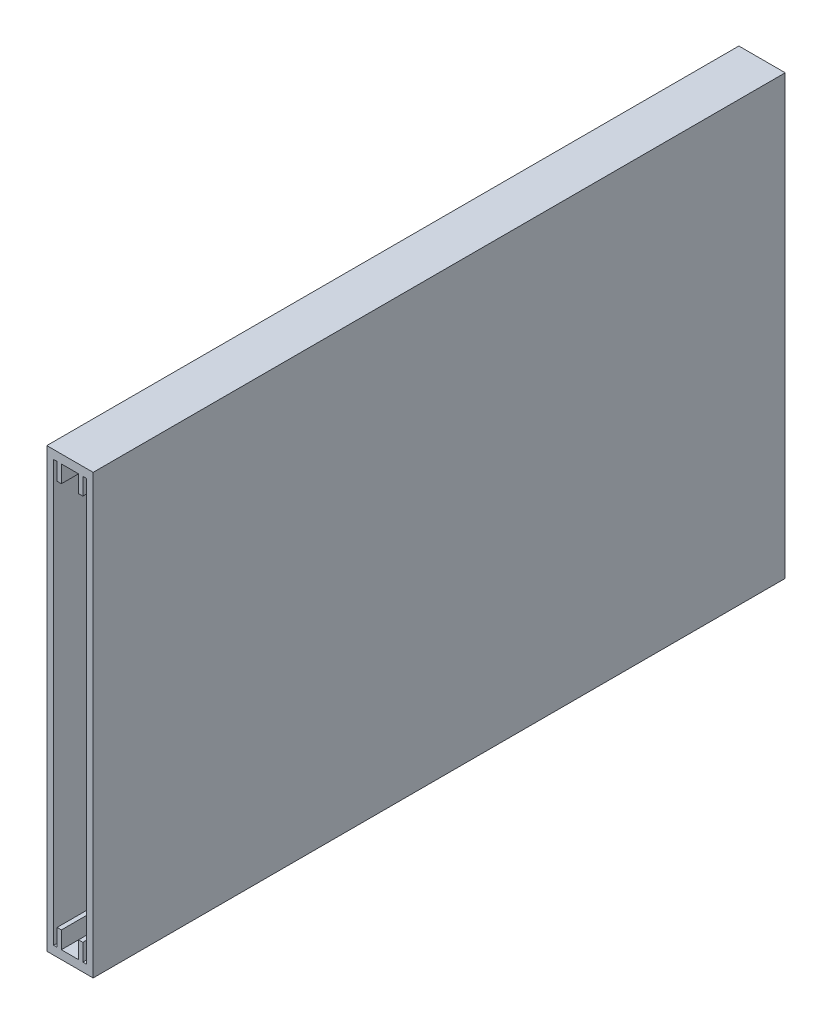
ISO-10303-21;
HEADER;
FILE_DESCRIPTION(('STEP AP214'),'2;1');
FILE_NAME('part.step','',(''),(''),'','','');
FILE_SCHEMA(('AUTOMOTIVE_DESIGN { 1 0 10303 214 1 1 1 1 }'));
ENDSEC;
DATA;
#1=APPLICATION_CONTEXT('core data for automotive mechanical design processes');
#2=APPLICATION_PROTOCOL_DEFINITION('international standard','automotive_design',2000,#1);
#3=PRODUCT_CONTEXT('',#1,'mechanical');
#4=PRODUCT('Part','Part','',(#3));
#5=PRODUCT_RELATED_PRODUCT_CATEGORY('part','',(#4));
#6=PRODUCT_DEFINITION_FORMATION('','',#4);
#7=PRODUCT_DEFINITION_CONTEXT('part definition',#1,'design');
#8=PRODUCT_DEFINITION('design','',#6,#7);
#9=PRODUCT_DEFINITION_SHAPE('','',#8);
#10=(LENGTH_UNIT() NAMED_UNIT(*) SI_UNIT(.MILLI.,.METRE.));
#11=(NAMED_UNIT(*) PLANE_ANGLE_UNIT() SI_UNIT($,.RADIAN.));
#12=(NAMED_UNIT(*) SI_UNIT($,.STERADIAN.) SOLID_ANGLE_UNIT());
#13=UNCERTAINTY_MEASURE_WITH_UNIT(LENGTH_MEASURE(1.E-05),#10,'distance_accuracy_value','');
#14=(GEOMETRIC_REPRESENTATION_CONTEXT(3) GLOBAL_UNCERTAINTY_ASSIGNED_CONTEXT((#13)) GLOBAL_UNIT_ASSIGNED_CONTEXT((#10,
#11,#12)) REPRESENTATION_CONTEXT('',''));
#15=CARTESIAN_POINT('',(0.,0.,0.));
#16=DIRECTION('',(0.,0.,1.));
#17=DIRECTION('',(1.,0.,0.));
#18=AXIS2_PLACEMENT_3D('',#15,#16,#17);
#19=CARTESIAN_POINT('',(0.,0.,1.2));
#20=DIRECTION('',(0.,1.,0.));
#21=DIRECTION('',(0.,0.,1.));
#22=AXIS2_PLACEMENT_3D('',#19,#20,#21);
#23=PLANE('',#22);
#24=DIRECTION('',(1.,0.,0.));
#25=VECTOR('',#24,1.);
#26=CARTESIAN_POINT('',(0.,0.,0.));
#27=LINE('',#26,#25);
#28=CARTESIAN_POINT('',(-10.8,0.,0.));
#29=VERTEX_POINT('',#28);
#30=CARTESIAN_POINT('',(0.,0.,0.));
#31=VERTEX_POINT('',#30);
#32=EDGE_CURVE('E365',#29,#31,#27,.T.);
#33=ORIENTED_EDGE('',*,*,#32,.T.);
#34=DIRECTION('',(0.,0.,-1.));
#35=VECTOR('',#34,1.);
#36=CARTESIAN_POINT('',(0.,0.,1.2));
#37=LINE('',#36,#35);
#38=CARTESIAN_POINT('',(0.,0.,161.2));
#39=VERTEX_POINT('',#38);
#40=EDGE_CURVE('E11',#39,#31,#37,.T.);
#41=ORIENTED_EDGE('',*,*,#40,.F.);
#42=DIRECTION('',(1.,0.,0.));
#43=VECTOR('',#42,1.);
#44=CARTESIAN_POINT('',(-10.8,0.,161.2));
#45=LINE('',#44,#43);
#46=CARTESIAN_POINT('',(-10.8,0.,161.2));
#47=VERTEX_POINT('',#46);
#48=EDGE_CURVE('E356',#47,#39,#45,.T.);
#49=ORIENTED_EDGE('',*,*,#48,.F.);
#50=DIRECTION('',(0.,0.,-1.));
#51=VECTOR('',#50,1.);
#52=CARTESIAN_POINT('',(-10.8,0.,1.2));
#53=LINE('',#52,#51);
#54=EDGE_CURVE('E373',#47,#29,#53,.T.);
#55=ORIENTED_EDGE('',*,*,#54,.T.);
#56=EDGE_LOOP('',(#33,#41,#49,#55));
#57=FACE_BOUND('',#56,.T.);
#58=ADVANCED_FACE('F39',(#57),#23,.F.);
#59=CARTESIAN_POINT('',(0.,0.,1.2));
#60=DIRECTION('',(-1.,0.,0.));
#61=DIRECTION('',(0.,0.,1.));
#62=AXIS2_PLACEMENT_3D('',#59,#60,#61);
#63=PLANE('',#62);
#64=DIRECTION('',(0.,1.,0.));
#65=VECTOR('',#64,1.);
#66=CARTESIAN_POINT('',(0.,0.,0.));
#67=LINE('',#66,#65);
#68=CARTESIAN_POINT('',(0.,102.,0.));
#69=VERTEX_POINT('',#68);
#70=EDGE_CURVE('E368',#31,#69,#67,.T.);
#71=ORIENTED_EDGE('',*,*,#70,.T.);
#72=DIRECTION('',(0.,0.,-1.));
#73=VECTOR('',#72,1.);
#74=CARTESIAN_POINT('',(0.,102.,1.2));
#75=LINE('',#74,#73);
#76=CARTESIAN_POINT('',(0.,102.,161.2));
#77=VERTEX_POINT('',#76);
#78=EDGE_CURVE('E46',#77,#69,#75,.T.);
#79=ORIENTED_EDGE('',*,*,#78,.F.);
#80=DIRECTION('',(0.,1.,0.));
#81=VECTOR('',#80,1.);
#82=CARTESIAN_POINT('',(0.,102.,161.2));
#83=LINE('',#82,#81);
#84=EDGE_CURVE('E359',#39,#77,#83,.T.);
#85=ORIENTED_EDGE('',*,*,#84,.F.);
#86=ORIENTED_EDGE('',*,*,#40,.T.);
#87=EDGE_LOOP('',(#71,#79,#85,#86));
#88=FACE_BOUND('',#87,.T.);
#89=ADVANCED_FACE('F391',(#88),#63,.F.);
#90=CARTESIAN_POINT('',(0.,102.,1.2));
#91=DIRECTION('',(0.,-1.,0.));
#92=DIRECTION('',(0.,0.,-1.));
#93=AXIS2_PLACEMENT_3D('',#90,#91,#92);
#94=PLANE('',#93);
#95=DIRECTION('',(-1.,0.,0.));
#96=VECTOR('',#95,1.);
#97=CARTESIAN_POINT('',(0.,102.,0.));
#98=LINE('',#97,#96);
#99=CARTESIAN_POINT('',(-10.8,102.,0.));
#100=VERTEX_POINT('',#99);
#101=EDGE_CURVE('E370',#69,#100,#98,.T.);
#102=ORIENTED_EDGE('',*,*,#101,.T.);
#103=DIRECTION('',(0.,0.,-1.));
#104=VECTOR('',#103,1.);
#105=CARTESIAN_POINT('',(-10.8,102.,1.2));
#106=LINE('',#105,#104);
#107=CARTESIAN_POINT('',(-10.8,102.,161.2));
#108=VERTEX_POINT('',#107);
#109=EDGE_CURVE('E375',#108,#100,#106,.T.);
#110=ORIENTED_EDGE('',*,*,#109,.F.);
#111=DIRECTION('',(-1.,0.,0.));
#112=VECTOR('',#111,1.);
#113=CARTESIAN_POINT('',(-10.8,102.,161.2));
#114=LINE('',#113,#112);
#115=EDGE_CURVE('E362',#77,#108,#114,.T.);
#116=ORIENTED_EDGE('',*,*,#115,.F.);
#117=ORIENTED_EDGE('',*,*,#78,.T.);
#118=EDGE_LOOP('',(#102,#110,#116,#117));
#119=FACE_BOUND('',#118,.T.);
#120=ADVANCED_FACE('F380',(#119),#94,.F.);
#121=CARTESIAN_POINT('',(-10.8,0.,1.2));
#122=DIRECTION('',(1.,0.,0.));
#123=DIRECTION('',(0.,0.,-1.));
#124=AXIS2_PLACEMENT_3D('',#121,#122,#123);
#125=PLANE('',#124);
#126=DIRECTION('',(0.,-1.,0.));
#127=VECTOR('',#126,1.);
#128=CARTESIAN_POINT('',(-10.8,0.,0.));
#129=LINE('',#128,#127);
#130=EDGE_CURVE('E61',#100,#29,#129,.T.);
#131=ORIENTED_EDGE('',*,*,#130,.T.);
#132=ORIENTED_EDGE('',*,*,#54,.F.);
#133=DIRECTION('',(0.,-1.,0.));
#134=VECTOR('',#133,1.);
#135=CARTESIAN_POINT('',(-10.8,102.,161.2));
#136=LINE('',#135,#134);
#137=EDGE_CURVE('E217',#108,#47,#136,.T.);
#138=ORIENTED_EDGE('',*,*,#137,.F.);
#139=ORIENTED_EDGE('',*,*,#109,.T.);
#140=EDGE_LOOP('',(#131,#132,#138,#139));
#141=FACE_BOUND('',#140,.T.);
#142=ADVANCED_FACE('F389',(#141),#125,.F.);
#143=CARTESIAN_POINT('',(0.,0.,0.));
#144=DIRECTION('',(0.,0.,-1.));
#145=DIRECTION('',(-1.,0.,0.));
#146=AXIS2_PLACEMENT_3D('',#143,#144,#145);
#147=PLANE('',#146);
#148=ORIENTED_EDGE('',*,*,#32,.F.);
#149=ORIENTED_EDGE('',*,*,#130,.F.);
#150=ORIENTED_EDGE('',*,*,#101,.F.);
#151=ORIENTED_EDGE('',*,*,#70,.F.);
#152=EDGE_LOOP('',(#148,#149,#150,#151));
#153=FACE_BOUND('',#152,.T.);
#154=ADVANCED_FACE('F385',(#153),#147,.T.);
#155=CARTESIAN_POINT('',(0.,0.,161.2));
#156=DIRECTION('',(0.,0.,1.));
#157=DIRECTION('',(1.,0.,0.));
#158=AXIS2_PLACEMENT_3D('',#155,#156,#157);
#159=PLANE('',#158);
#160=ORIENTED_EDGE('',*,*,#137,.T.);
#161=ORIENTED_EDGE('',*,*,#48,.T.);
#162=ORIENTED_EDGE('',*,*,#84,.T.);
#163=ORIENTED_EDGE('',*,*,#115,.T.);
#164=EDGE_LOOP('',(#160,#161,#162,#163));
#165=FACE_BOUND('',#164,.T.);
#166=DIRECTION('',(1.,0.,0.));
#167=VECTOR('',#166,1.);
#168=CARTESIAN_POINT('',(-9.19999999999999,2.,161.2));
#169=LINE('',#168,#167);
#170=CARTESIAN_POINT('',(-9.19999999999999,2.,161.2));
#171=VERTEX_POINT('',#170);
#172=CARTESIAN_POINT('',(-8.4000000000095,2.,161.2));
#173=VERTEX_POINT('',#172);
#174=EDGE_CURVE('E209',#171,#173,#169,.T.);
#175=ORIENTED_EDGE('',*,*,#174,.F.);
#176=DIRECTION('',(0.,-1.,0.));
#177=VECTOR('',#176,1.);
#178=CARTESIAN_POINT('',(-9.20000000000004,100.,161.2));
#179=LINE('',#178,#177);
#180=CARTESIAN_POINT('',(-9.20000000000004,100.,161.2));
#181=VERTEX_POINT('',#180);
#182=EDGE_CURVE('E201',#181,#171,#179,.T.);
#183=ORIENTED_EDGE('',*,*,#182,.F.);
#184=DIRECTION('',(-1.,0.,0.));
#185=VECTOR('',#184,1.);
#186=CARTESIAN_POINT('',(-9.20000000000004,100.,161.2));
#187=LINE('',#186,#185);
#188=CARTESIAN_POINT('',(-8.40000000000004,100.,161.2));
#189=VERTEX_POINT('',#188);
#190=EDGE_CURVE('E260',#189,#181,#187,.T.);
#191=ORIENTED_EDGE('',*,*,#190,.F.);
#192=DIRECTION('',(0.,1.,0.));
#193=VECTOR('',#192,1.);
#194=CARTESIAN_POINT('',(-8.40000000000004,96.,161.2));
#195=LINE('',#194,#193);
#196=CARTESIAN_POINT('',(-8.40000000000004,96.,161.2));
#197=VERTEX_POINT('',#196);
#198=EDGE_CURVE('E257',#197,#189,#195,.T.);
#199=ORIENTED_EDGE('',*,*,#198,.F.);
#200=DIRECTION('',(-1.,0.,0.));
#201=VECTOR('',#200,1.);
#202=CARTESIAN_POINT('',(-8.40000000000004,96.,161.2));
#203=LINE('',#202,#201);
#204=CARTESIAN_POINT('',(-7.40000000000004,96.,161.2));
#205=VERTEX_POINT('',#204);
#206=EDGE_CURVE('E255',#205,#197,#203,.T.);
#207=ORIENTED_EDGE('',*,*,#206,.F.);
#208=DIRECTION('',(0.,-1.,0.));
#209=VECTOR('',#208,1.);
#210=CARTESIAN_POINT('',(-7.40000000000004,96.,161.2));
#211=LINE('',#210,#209);
#212=CARTESIAN_POINT('',(-7.40000000000004,100.,161.2));
#213=VERTEX_POINT('',#212);
#214=EDGE_CURVE('E253',#213,#205,#211,.T.);
#215=ORIENTED_EDGE('',*,*,#214,.F.);
#216=DIRECTION('',(-1.,0.,0.));
#217=VECTOR('',#216,1.);
#218=CARTESIAN_POINT('',(-7.40000000000004,100.,161.2));
#219=LINE('',#218,#217);
#220=CARTESIAN_POINT('',(-3.40000000000004,100.,161.2));
#221=VERTEX_POINT('',#220);
#222=EDGE_CURVE('E251',#221,#213,#219,.T.);
#223=ORIENTED_EDGE('',*,*,#222,.F.);
#224=DIRECTION('',(0.,1.,0.));
#225=VECTOR('',#224,1.);
#226=CARTESIAN_POINT('',(-3.4,96.,161.2));
#227=LINE('',#226,#225);
#228=CARTESIAN_POINT('',(-3.4,96.,161.2));
#229=VERTEX_POINT('',#228);
#230=EDGE_CURVE('E249',#229,#221,#227,.T.);
#231=ORIENTED_EDGE('',*,*,#230,.F.);
#232=DIRECTION('',(-1.,0.,0.));
#233=VECTOR('',#232,1.);
#234=CARTESIAN_POINT('',(-3.4,96.,161.2));
#235=LINE('',#234,#233);
#236=CARTESIAN_POINT('',(-2.4,96.,161.2));
#237=VERTEX_POINT('',#236);
#238=EDGE_CURVE('E247',#237,#229,#235,.T.);
#239=ORIENTED_EDGE('',*,*,#238,.F.);
#240=DIRECTION('',(0.,-1.,0.));
#241=VECTOR('',#240,1.);
#242=CARTESIAN_POINT('',(-2.4,96.,161.2));
#243=LINE('',#242,#241);
#244=CARTESIAN_POINT('',(-2.4,100.,161.2));
#245=VERTEX_POINT('',#244);
#246=EDGE_CURVE('E245',#245,#237,#243,.T.);
#247=ORIENTED_EDGE('',*,*,#246,.F.);
#248=DIRECTION('',(-1.,0.,0.));
#249=VECTOR('',#248,1.);
#250=CARTESIAN_POINT('',(-2.4,100.,161.2));
#251=LINE('',#250,#249);
#252=CARTESIAN_POINT('',(-1.6,100.,161.2));
#253=VERTEX_POINT('',#252);
#254=EDGE_CURVE('E243',#253,#245,#251,.T.);
#255=ORIENTED_EDGE('',*,*,#254,.F.);
#256=DIRECTION('',(0.,1.,0.));
#257=VECTOR('',#256,1.);
#258=CARTESIAN_POINT('',(-1.6,100.,161.2));
#259=LINE('',#258,#257);
#260=CARTESIAN_POINT('',(-1.59999999999999,2.,161.2));
#261=VERTEX_POINT('',#260);
#262=EDGE_CURVE('E241',#261,#253,#259,.T.);
#263=ORIENTED_EDGE('',*,*,#262,.F.);
#264=DIRECTION('',(1.,0.,0.));
#265=VECTOR('',#264,1.);
#266=CARTESIAN_POINT('',(-2.39999999999999,2.,161.2));
#267=LINE('',#266,#265);
#268=CARTESIAN_POINT('',(-2.39999999999999,2.,161.2));
#269=VERTEX_POINT('',#268);
#270=EDGE_CURVE('E239',#269,#261,#267,.T.);
#271=ORIENTED_EDGE('',*,*,#270,.F.);
#272=DIRECTION('',(0.,-1.,0.));
#273=VECTOR('',#272,1.);
#274=CARTESIAN_POINT('',(-2.39999999999999,2.,161.2));
#275=LINE('',#274,#273);
#276=CARTESIAN_POINT('',(-2.39999999999999,5.99999999999534,161.2));
#277=VERTEX_POINT('',#276);
#278=EDGE_CURVE('E237',#277,#269,#275,.T.);
#279=ORIENTED_EDGE('',*,*,#278,.F.);
#280=DIRECTION('',(1.,0.,0.));
#281=VECTOR('',#280,1.);
#282=CARTESIAN_POINT('',(-3.39999999999999,5.99999999999534,161.2));
#283=LINE('',#282,#281);
#284=CARTESIAN_POINT('',(-3.39999999999999,5.99999999999534,161.2));
#285=VERTEX_POINT('',#284);
#286=EDGE_CURVE('E235',#285,#277,#283,.T.);
#287=ORIENTED_EDGE('',*,*,#286,.F.);
#288=DIRECTION('',(0.,1.,0.));
#289=VECTOR('',#288,1.);
#290=CARTESIAN_POINT('',(-3.39999999999999,2.,161.2));
#291=LINE('',#290,#289);
#292=CARTESIAN_POINT('',(-3.39999999999999,2.,161.2));
#293=VERTEX_POINT('',#292);
#294=EDGE_CURVE('E233',#293,#285,#291,.T.);
#295=ORIENTED_EDGE('',*,*,#294,.F.);
#296=DIRECTION('',(1.,0.,0.));
#297=VECTOR('',#296,1.);
#298=CARTESIAN_POINT('',(-7.4000000000095,2.,161.2));
#299=LINE('',#298,#297);
#300=CARTESIAN_POINT('',(-7.4000000000095,2.,161.2));
#301=VERTEX_POINT('',#300);
#302=EDGE_CURVE('E231',#301,#293,#299,.T.);
#303=ORIENTED_EDGE('',*,*,#302,.F.);
#304=DIRECTION('',(0.,-1.,0.));
#305=VECTOR('',#304,1.);
#306=CARTESIAN_POINT('',(-7.4000000000095,2.,161.2));
#307=LINE('',#306,#305);
#308=CARTESIAN_POINT('',(-7.4000000000095,5.99999999999534,161.2));
#309=VERTEX_POINT('',#308);
#310=EDGE_CURVE('E229',#309,#301,#307,.T.);
#311=ORIENTED_EDGE('',*,*,#310,.F.);
#312=DIRECTION('',(1.,0.,0.));
#313=VECTOR('',#312,1.);
#314=CARTESIAN_POINT('',(-8.4000000000095,5.99999999999534,161.2));
#315=LINE('',#314,#313);
#316=CARTESIAN_POINT('',(-8.4000000000095,5.99999999999534,161.2));
#317=VERTEX_POINT('',#316);
#318=EDGE_CURVE('E225',#317,#309,#315,.T.);
#319=ORIENTED_EDGE('',*,*,#318,.F.);
#320=DIRECTION('',(0.,1.,0.));
#321=VECTOR('',#320,1.);
#322=CARTESIAN_POINT('',(-8.4000000000095,2.,161.2));
#323=LINE('',#322,#321);
#324=EDGE_CURVE('E223',#173,#317,#323,.T.);
#325=ORIENTED_EDGE('',*,*,#324,.F.);
#326=EDGE_LOOP('',(#175,#183,#191,#199,#207,#215,#223,#231,#239,#247,#255,#263,#271,#279,#287,
#295,#303,#311,#319,#325));
#327=FACE_BOUND('',#326,.T.);
#328=ADVANCED_FACE('F221',(#165,#327),#159,.T.);
#329=CARTESIAN_POINT('',(-9.20000000000004,100.,161.2));
#330=DIRECTION('',(1.,0.,0.));
#331=DIRECTION('',(0.,1.,0.));
#332=AXIS2_PLACEMENT_3D('',#329,#330,#331);
#333=PLANE('',#332);
#334=DIRECTION('',(0.,-1.,0.));
#335=VECTOR('',#334,1.);
#336=CARTESIAN_POINT('',(-9.20000000000004,100.,1.2));
#337=LINE('',#336,#335);
#338=CARTESIAN_POINT('',(-9.20000000000004,100.,1.2));
#339=VERTEX_POINT('',#338);
#340=CARTESIAN_POINT('',(-9.19999999999999,2.,1.2));
#341=VERTEX_POINT('',#340);
#342=EDGE_CURVE('E262',#339,#341,#337,.T.);
#343=ORIENTED_EDGE('',*,*,#342,.F.);
#344=DIRECTION('',(0.,0.,-1.));
#345=VECTOR('',#344,1.);
#346=CARTESIAN_POINT('',(-9.20000000000004,100.,161.2));
#347=LINE('',#346,#345);
#348=EDGE_CURVE('E53',#181,#339,#347,.T.);
#349=ORIENTED_EDGE('',*,*,#348,.F.);
#350=ORIENTED_EDGE('',*,*,#182,.T.);
#351=DIRECTION('',(0.,0.,-1.));
#352=VECTOR('',#351,1.);
#353=CARTESIAN_POINT('',(-9.19999999999999,2.,161.2));
#354=LINE('',#353,#352);
#355=EDGE_CURVE('E204',#171,#341,#354,.T.);
#356=ORIENTED_EDGE('',*,*,#355,.T.);
#357=EDGE_LOOP('',(#343,#349,#350,#356));
#358=FACE_BOUND('',#357,.T.);
#359=ADVANCED_FACE('F203',(#358),#333,.T.);
#360=CARTESIAN_POINT('',(-9.19999999999999,2.,161.2));
#361=DIRECTION('',(0.,1.,0.));
#362=DIRECTION('',(-1.,0.,0.));
#363=AXIS2_PLACEMENT_3D('',#360,#361,#362);
#364=PLANE('',#363);
#365=DIRECTION('',(1.,0.,0.));
#366=VECTOR('',#365,1.);
#367=CARTESIAN_POINT('',(-9.19999999999999,2.,1.2));
#368=LINE('',#367,#366);
#369=CARTESIAN_POINT('',(-8.4000000000095,2.,1.2));
#370=VERTEX_POINT('',#369);
#371=EDGE_CURVE('E216',#341,#370,#368,.T.);
#372=ORIENTED_EDGE('',*,*,#371,.F.);
#373=ORIENTED_EDGE('',*,*,#355,.F.);
#374=ORIENTED_EDGE('',*,*,#174,.T.);
#375=DIRECTION('',(0.,0.,-1.));
#376=VECTOR('',#375,1.);
#377=CARTESIAN_POINT('',(-8.4000000000095,2.,161.2));
#378=LINE('',#377,#376);
#379=EDGE_CURVE('E218',#173,#370,#378,.T.);
#380=ORIENTED_EDGE('',*,*,#379,.T.);
#381=EDGE_LOOP('',(#372,#373,#374,#380));
#382=FACE_BOUND('',#381,.T.);
#383=ADVANCED_FACE('F213',(#382),#364,.T.);
#384=CARTESIAN_POINT('',(-8.4000000000095,2.,161.2));
#385=DIRECTION('',(-1.,0.,0.));
#386=DIRECTION('',(0.,-1.,0.));
#387=AXIS2_PLACEMENT_3D('',#384,#385,#386);
#388=PLANE('',#387);
#389=DIRECTION('',(0.,1.,0.));
#390=VECTOR('',#389,1.);
#391=CARTESIAN_POINT('',(-8.4000000000095,2.,1.2));
#392=LINE('',#391,#390);
#393=CARTESIAN_POINT('',(-8.4000000000095,5.99999999999534,1.2));
#394=VERTEX_POINT('',#393);
#395=EDGE_CURVE('E265',#370,#394,#392,.T.);
#396=ORIENTED_EDGE('',*,*,#395,.F.);
#397=ORIENTED_EDGE('',*,*,#379,.F.);
#398=ORIENTED_EDGE('',*,*,#324,.T.);
#399=DIRECTION('',(0.,0.,-1.));
#400=VECTOR('',#399,1.);
#401=CARTESIAN_POINT('',(-8.4000000000095,5.99999999999534,161.2));
#402=LINE('',#401,#400);
#403=EDGE_CURVE('E351',#317,#394,#402,.T.);
#404=ORIENTED_EDGE('',*,*,#403,.T.);
#405=EDGE_LOOP('',(#396,#397,#398,#404));
#406=FACE_BOUND('',#405,.T.);
#407=ADVANCED_FACE('F414',(#406),#388,.T.);
#408=CARTESIAN_POINT('',(-8.4000000000095,5.99999999999534,161.2));
#409=DIRECTION('',(0.,1.,0.));
#410=DIRECTION('',(-1.,0.,0.));
#411=AXIS2_PLACEMENT_3D('',#408,#409,#410);
#412=PLANE('',#411);
#413=DIRECTION('',(1.,0.,0.));
#414=VECTOR('',#413,1.);
#415=CARTESIAN_POINT('',(-8.4000000000095,5.99999999999534,1.2));
#416=LINE('',#415,#414);
#417=CARTESIAN_POINT('',(-7.4000000000095,5.99999999999534,1.2));
#418=VERTEX_POINT('',#417);
#419=EDGE_CURVE('E268',#394,#418,#416,.T.);
#420=ORIENTED_EDGE('',*,*,#419,.F.);
#421=ORIENTED_EDGE('',*,*,#403,.F.);
#422=ORIENTED_EDGE('',*,*,#318,.T.);
#423=DIRECTION('',(0.,0.,-1.));
#424=VECTOR('',#423,1.);
#425=CARTESIAN_POINT('',(-7.4000000000095,5.99999999999534,161.2));
#426=LINE('',#425,#424);
#427=EDGE_CURVE('E349',#309,#418,#426,.T.);
#428=ORIENTED_EDGE('',*,*,#427,.T.);
#429=EDGE_LOOP('',(#420,#421,#422,#428));
#430=FACE_BOUND('',#429,.T.);
#431=ADVANCED_FACE('F417',(#430),#412,.T.);
#432=CARTESIAN_POINT('',(-7.4000000000095,2.,161.2));
#433=DIRECTION('',(1.,0.,0.));
#434=DIRECTION('',(0.,1.,0.));
#435=AXIS2_PLACEMENT_3D('',#432,#433,#434);
#436=PLANE('',#435);
#437=DIRECTION('',(0.,-1.,0.));
#438=VECTOR('',#437,1.);
#439=CARTESIAN_POINT('',(-7.4000000000095,2.,1.2));
#440=LINE('',#439,#438);
#441=CARTESIAN_POINT('',(-7.4000000000095,2.,1.2));
#442=VERTEX_POINT('',#441);
#443=EDGE_CURVE('E271',#418,#442,#440,.T.);
#444=ORIENTED_EDGE('',*,*,#443,.F.);
#445=ORIENTED_EDGE('',*,*,#427,.F.);
#446=ORIENTED_EDGE('',*,*,#310,.T.);
#447=DIRECTION('',(0.,0.,-1.));
#448=VECTOR('',#447,1.);
#449=CARTESIAN_POINT('',(-7.4000000000095,2.,161.2));
#450=LINE('',#449,#448);
#451=EDGE_CURVE('E347',#301,#442,#450,.T.);
#452=ORIENTED_EDGE('',*,*,#451,.T.);
#453=EDGE_LOOP('',(#444,#445,#446,#452));
#454=FACE_BOUND('',#453,.T.);
#455=ADVANCED_FACE('F421',(#454),#436,.T.);
#456=CARTESIAN_POINT('',(-7.4000000000095,2.,161.2));
#457=DIRECTION('',(0.,1.,0.));
#458=DIRECTION('',(-1.,0.,0.));
#459=AXIS2_PLACEMENT_3D('',#456,#457,#458);
#460=PLANE('',#459);
#461=DIRECTION('',(1.,0.,0.));
#462=VECTOR('',#461,1.);
#463=CARTESIAN_POINT('',(-7.4000000000095,2.,1.2));
#464=LINE('',#463,#462);
#465=CARTESIAN_POINT('',(-3.39999999999999,2.,1.2));
#466=VERTEX_POINT('',#465);
#467=EDGE_CURVE('E274',#442,#466,#464,.T.);
#468=ORIENTED_EDGE('',*,*,#467,.F.);
#469=ORIENTED_EDGE('',*,*,#451,.F.);
#470=ORIENTED_EDGE('',*,*,#302,.T.);
#471=DIRECTION('',(0.,0.,-1.));
#472=VECTOR('',#471,1.);
#473=CARTESIAN_POINT('',(-3.39999999999999,2.,161.2));
#474=LINE('',#473,#472);
#475=EDGE_CURVE('E345',#293,#466,#474,.T.);
#476=ORIENTED_EDGE('',*,*,#475,.T.);
#477=EDGE_LOOP('',(#468,#469,#470,#476));
#478=FACE_BOUND('',#477,.T.);
#479=ADVANCED_FACE('F425',(#478),#460,.T.);
#480=CARTESIAN_POINT('',(-3.39999999999999,2.,161.2));
#481=DIRECTION('',(-1.,0.,0.));
#482=DIRECTION('',(0.,-1.,0.));
#483=AXIS2_PLACEMENT_3D('',#480,#481,#482);
#484=PLANE('',#483);
#485=DIRECTION('',(0.,1.,0.));
#486=VECTOR('',#485,1.);
#487=CARTESIAN_POINT('',(-3.39999999999999,2.,1.2));
#488=LINE('',#487,#486);
#489=CARTESIAN_POINT('',(-3.39999999999999,5.99999999999534,1.2));
#490=VERTEX_POINT('',#489);
#491=EDGE_CURVE('E277',#466,#490,#488,.T.);
#492=ORIENTED_EDGE('',*,*,#491,.F.);
#493=ORIENTED_EDGE('',*,*,#475,.F.);
#494=ORIENTED_EDGE('',*,*,#294,.T.);
#495=DIRECTION('',(0.,0.,-1.));
#496=VECTOR('',#495,1.);
#497=CARTESIAN_POINT('',(-3.39999999999999,5.99999999999534,161.2));
#498=LINE('',#497,#496);
#499=EDGE_CURVE('E343',#285,#490,#498,.T.);
#500=ORIENTED_EDGE('',*,*,#499,.T.);
#501=EDGE_LOOP('',(#492,#493,#494,#500));
#502=FACE_BOUND('',#501,.T.);
#503=ADVANCED_FACE('F429',(#502),#484,.T.);
#504=CARTESIAN_POINT('',(-3.39999999999999,5.99999999999534,161.2));
#505=DIRECTION('',(0.,1.,0.));
#506=DIRECTION('',(-1.,0.,0.));
#507=AXIS2_PLACEMENT_3D('',#504,#505,#506);
#508=PLANE('',#507);
#509=DIRECTION('',(1.,0.,0.));
#510=VECTOR('',#509,1.);
#511=CARTESIAN_POINT('',(-3.39999999999999,5.99999999999534,1.2));
#512=LINE('',#511,#510);
#513=CARTESIAN_POINT('',(-2.39999999999999,5.99999999999534,1.2));
#514=VERTEX_POINT('',#513);
#515=EDGE_CURVE('E280',#490,#514,#512,.T.);
#516=ORIENTED_EDGE('',*,*,#515,.F.);
#517=ORIENTED_EDGE('',*,*,#499,.F.);
#518=ORIENTED_EDGE('',*,*,#286,.T.);
#519=DIRECTION('',(0.,0.,-1.));
#520=VECTOR('',#519,1.);
#521=CARTESIAN_POINT('',(-2.39999999999999,5.99999999999534,161.2));
#522=LINE('',#521,#520);
#523=EDGE_CURVE('E341',#277,#514,#522,.T.);
#524=ORIENTED_EDGE('',*,*,#523,.T.);
#525=EDGE_LOOP('',(#516,#517,#518,#524));
#526=FACE_BOUND('',#525,.T.);
#527=ADVANCED_FACE('F433',(#526),#508,.T.);
#528=CARTESIAN_POINT('',(-2.39999999999999,2.,161.2));
#529=DIRECTION('',(1.,0.,0.));
#530=DIRECTION('',(0.,1.,0.));
#531=AXIS2_PLACEMENT_3D('',#528,#529,#530);
#532=PLANE('',#531);
#533=DIRECTION('',(0.,-1.,0.));
#534=VECTOR('',#533,1.);
#535=CARTESIAN_POINT('',(-2.39999999999999,2.,1.2));
#536=LINE('',#535,#534);
#537=CARTESIAN_POINT('',(-2.39999999999999,2.,1.2));
#538=VERTEX_POINT('',#537);
#539=EDGE_CURVE('E283',#514,#538,#536,.T.);
#540=ORIENTED_EDGE('',*,*,#539,.F.);
#541=ORIENTED_EDGE('',*,*,#523,.F.);
#542=ORIENTED_EDGE('',*,*,#278,.T.);
#543=DIRECTION('',(0.,0.,-1.));
#544=VECTOR('',#543,1.);
#545=CARTESIAN_POINT('',(-2.39999999999999,2.,161.2));
#546=LINE('',#545,#544);
#547=EDGE_CURVE('E339',#269,#538,#546,.T.);
#548=ORIENTED_EDGE('',*,*,#547,.T.);
#549=EDGE_LOOP('',(#540,#541,#542,#548));
#550=FACE_BOUND('',#549,.T.);
#551=ADVANCED_FACE('F437',(#550),#532,.T.);
#552=CARTESIAN_POINT('',(-2.39999999999999,2.,161.2));
#553=DIRECTION('',(0.,1.,0.));
#554=DIRECTION('',(-1.,0.,0.));
#555=AXIS2_PLACEMENT_3D('',#552,#553,#554);
#556=PLANE('',#555);
#557=DIRECTION('',(1.,0.,0.));
#558=VECTOR('',#557,1.);
#559=CARTESIAN_POINT('',(-2.39999999999999,2.,1.2));
#560=LINE('',#559,#558);
#561=CARTESIAN_POINT('',(-1.59999999999999,2.,1.2));
#562=VERTEX_POINT('',#561);
#563=EDGE_CURVE('E286',#538,#562,#560,.T.);
#564=ORIENTED_EDGE('',*,*,#563,.F.);
#565=ORIENTED_EDGE('',*,*,#547,.F.);
#566=ORIENTED_EDGE('',*,*,#270,.T.);
#567=DIRECTION('',(0.,0.,-1.));
#568=VECTOR('',#567,1.);
#569=CARTESIAN_POINT('',(-1.59999999999999,2.,161.2));
#570=LINE('',#569,#568);
#571=EDGE_CURVE('E337',#261,#562,#570,.T.);
#572=ORIENTED_EDGE('',*,*,#571,.T.);
#573=EDGE_LOOP('',(#564,#565,#566,#572));
#574=FACE_BOUND('',#573,.T.);
#575=ADVANCED_FACE('F441',(#574),#556,.T.);
#576=CARTESIAN_POINT('',(-1.6,100.,161.2));
#577=DIRECTION('',(-1.,0.,0.));
#578=DIRECTION('',(0.,-1.,0.));
#579=AXIS2_PLACEMENT_3D('',#576,#577,#578);
#580=PLANE('',#579);
#581=DIRECTION('',(0.,1.,0.));
#582=VECTOR('',#581,1.);
#583=CARTESIAN_POINT('',(-1.6,100.,1.2));
#584=LINE('',#583,#582);
#585=CARTESIAN_POINT('',(-1.6,100.,1.2));
#586=VERTEX_POINT('',#585);
#587=EDGE_CURVE('E289',#562,#586,#584,.T.);
#588=ORIENTED_EDGE('',*,*,#587,.F.);
#589=ORIENTED_EDGE('',*,*,#571,.F.);
#590=ORIENTED_EDGE('',*,*,#262,.T.);
#591=DIRECTION('',(0.,0.,-1.));
#592=VECTOR('',#591,1.);
#593=CARTESIAN_POINT('',(-1.6,100.,161.2));
#594=LINE('',#593,#592);
#595=EDGE_CURVE('E335',#253,#586,#594,.T.);
#596=ORIENTED_EDGE('',*,*,#595,.T.);
#597=EDGE_LOOP('',(#588,#589,#590,#596));
#598=FACE_BOUND('',#597,.T.);
#599=ADVANCED_FACE('F445',(#598),#580,.T.);
#600=CARTESIAN_POINT('',(-2.4,100.,161.2));
#601=DIRECTION('',(0.,-1.,0.));
#602=DIRECTION('',(0.,0.,-1.));
#603=AXIS2_PLACEMENT_3D('',#600,#601,#602);
#604=PLANE('',#603);
#605=DIRECTION('',(-1.,0.,0.));
#606=VECTOR('',#605,1.);
#607=CARTESIAN_POINT('',(-2.4,100.,1.2));
#608=LINE('',#607,#606);
#609=CARTESIAN_POINT('',(-2.4,100.,1.2));
#610=VERTEX_POINT('',#609);
#611=EDGE_CURVE('E292',#586,#610,#608,.T.);
#612=ORIENTED_EDGE('',*,*,#611,.F.);
#613=ORIENTED_EDGE('',*,*,#595,.F.);
#614=ORIENTED_EDGE('',*,*,#254,.T.);
#615=DIRECTION('',(0.,0.,-1.));
#616=VECTOR('',#615,1.);
#617=CARTESIAN_POINT('',(-2.4,100.,161.2));
#618=LINE('',#617,#616);
#619=EDGE_CURVE('E333',#245,#610,#618,.T.);
#620=ORIENTED_EDGE('',*,*,#619,.T.);
#621=EDGE_LOOP('',(#612,#613,#614,#620));
#622=FACE_BOUND('',#621,.T.);
#623=ADVANCED_FACE('F449',(#622),#604,.T.);
#624=CARTESIAN_POINT('',(-2.4,96.,161.2));
#625=DIRECTION('',(1.,0.,0.));
#626=DIRECTION('',(0.,1.,0.));
#627=AXIS2_PLACEMENT_3D('',#624,#625,#626);
#628=PLANE('',#627);
#629=DIRECTION('',(0.,-1.,0.));
#630=VECTOR('',#629,1.);
#631=CARTESIAN_POINT('',(-2.4,96.,1.2));
#632=LINE('',#631,#630);
#633=CARTESIAN_POINT('',(-2.4,96.,1.2));
#634=VERTEX_POINT('',#633);
#635=EDGE_CURVE('E295',#610,#634,#632,.T.);
#636=ORIENTED_EDGE('',*,*,#635,.F.);
#637=ORIENTED_EDGE('',*,*,#619,.F.);
#638=ORIENTED_EDGE('',*,*,#246,.T.);
#639=DIRECTION('',(0.,0.,-1.));
#640=VECTOR('',#639,1.);
#641=CARTESIAN_POINT('',(-2.4,96.,161.2));
#642=LINE('',#641,#640);
#643=EDGE_CURVE('E331',#237,#634,#642,.T.);
#644=ORIENTED_EDGE('',*,*,#643,.T.);
#645=EDGE_LOOP('',(#636,#637,#638,#644));
#646=FACE_BOUND('',#645,.T.);
#647=ADVANCED_FACE('F453',(#646),#628,.T.);
#648=CARTESIAN_POINT('',(-3.4,96.,161.2));
#649=DIRECTION('',(0.,-1.,0.));
#650=DIRECTION('',(0.,0.,-1.));
#651=AXIS2_PLACEMENT_3D('',#648,#649,#650);
#652=PLANE('',#651);
#653=DIRECTION('',(-1.,0.,0.));
#654=VECTOR('',#653,1.);
#655=CARTESIAN_POINT('',(-3.4,96.,1.2));
#656=LINE('',#655,#654);
#657=CARTESIAN_POINT('',(-3.4,96.,1.2));
#658=VERTEX_POINT('',#657);
#659=EDGE_CURVE('E298',#634,#658,#656,.T.);
#660=ORIENTED_EDGE('',*,*,#659,.F.);
#661=ORIENTED_EDGE('',*,*,#643,.F.);
#662=ORIENTED_EDGE('',*,*,#238,.T.);
#663=DIRECTION('',(0.,0.,-1.));
#664=VECTOR('',#663,1.);
#665=CARTESIAN_POINT('',(-3.4,96.,161.2));
#666=LINE('',#665,#664);
#667=EDGE_CURVE('E329',#229,#658,#666,.T.);
#668=ORIENTED_EDGE('',*,*,#667,.T.);
#669=EDGE_LOOP('',(#660,#661,#662,#668));
#670=FACE_BOUND('',#669,.T.);
#671=ADVANCED_FACE('F457',(#670),#652,.T.);
#672=CARTESIAN_POINT('',(-3.4,96.,161.2));
#673=DIRECTION('',(-1.,0.,0.));
#674=DIRECTION('',(0.,-1.,0.));
#675=AXIS2_PLACEMENT_3D('',#672,#673,#674);
#676=PLANE('',#675);
#677=DIRECTION('',(0.,1.,0.));
#678=VECTOR('',#677,1.);
#679=CARTESIAN_POINT('',(-3.4,96.,1.2));
#680=LINE('',#679,#678);
#681=CARTESIAN_POINT('',(-3.40000000000004,100.,1.2));
#682=VERTEX_POINT('',#681);
#683=EDGE_CURVE('E301',#658,#682,#680,.T.);
#684=ORIENTED_EDGE('',*,*,#683,.F.);
#685=ORIENTED_EDGE('',*,*,#667,.F.);
#686=ORIENTED_EDGE('',*,*,#230,.T.);
#687=DIRECTION('',(0.,0.,-1.));
#688=VECTOR('',#687,1.);
#689=CARTESIAN_POINT('',(-3.40000000000004,100.,161.2));
#690=LINE('',#689,#688);
#691=EDGE_CURVE('E327',#221,#682,#690,.T.);
#692=ORIENTED_EDGE('',*,*,#691,.T.);
#693=EDGE_LOOP('',(#684,#685,#686,#692));
#694=FACE_BOUND('',#693,.T.);
#695=ADVANCED_FACE('F461',(#694),#676,.T.);
#696=CARTESIAN_POINT('',(-7.40000000000004,100.,161.2));
#697=DIRECTION('',(0.,-1.,0.));
#698=DIRECTION('',(0.,0.,-1.));
#699=AXIS2_PLACEMENT_3D('',#696,#697,#698);
#700=PLANE('',#699);
#701=DIRECTION('',(-1.,0.,0.));
#702=VECTOR('',#701,1.);
#703=CARTESIAN_POINT('',(-7.40000000000004,100.,1.2));
#704=LINE('',#703,#702);
#705=CARTESIAN_POINT('',(-7.40000000000004,100.,1.2));
#706=VERTEX_POINT('',#705);
#707=EDGE_CURVE('E304',#682,#706,#704,.T.);
#708=ORIENTED_EDGE('',*,*,#707,.F.);
#709=ORIENTED_EDGE('',*,*,#691,.F.);
#710=ORIENTED_EDGE('',*,*,#222,.T.);
#711=DIRECTION('',(0.,0.,-1.));
#712=VECTOR('',#711,1.);
#713=CARTESIAN_POINT('',(-7.40000000000004,100.,161.2));
#714=LINE('',#713,#712);
#715=EDGE_CURVE('E325',#213,#706,#714,.T.);
#716=ORIENTED_EDGE('',*,*,#715,.T.);
#717=EDGE_LOOP('',(#708,#709,#710,#716));
#718=FACE_BOUND('',#717,.T.);
#719=ADVANCED_FACE('F465',(#718),#700,.T.);
#720=CARTESIAN_POINT('',(-7.40000000000004,96.,161.2));
#721=DIRECTION('',(1.,0.,0.));
#722=DIRECTION('',(0.,1.,0.));
#723=AXIS2_PLACEMENT_3D('',#720,#721,#722);
#724=PLANE('',#723);
#725=DIRECTION('',(0.,-1.,0.));
#726=VECTOR('',#725,1.);
#727=CARTESIAN_POINT('',(-7.40000000000004,96.,1.2));
#728=LINE('',#727,#726);
#729=CARTESIAN_POINT('',(-7.40000000000004,96.,1.2));
#730=VERTEX_POINT('',#729);
#731=EDGE_CURVE('E307',#706,#730,#728,.T.);
#732=ORIENTED_EDGE('',*,*,#731,.F.);
#733=ORIENTED_EDGE('',*,*,#715,.F.);
#734=ORIENTED_EDGE('',*,*,#214,.T.);
#735=DIRECTION('',(0.,0.,-1.));
#736=VECTOR('',#735,1.);
#737=CARTESIAN_POINT('',(-7.40000000000004,96.,161.2));
#738=LINE('',#737,#736);
#739=EDGE_CURVE('E323',#205,#730,#738,.T.);
#740=ORIENTED_EDGE('',*,*,#739,.T.);
#741=EDGE_LOOP('',(#732,#733,#734,#740));
#742=FACE_BOUND('',#741,.T.);
#743=ADVANCED_FACE('F469',(#742),#724,.T.);
#744=CARTESIAN_POINT('',(-8.40000000000004,96.,161.2));
#745=DIRECTION('',(0.,-1.,0.));
#746=DIRECTION('',(1.,0.,0.));
#747=AXIS2_PLACEMENT_3D('',#744,#745,#746);
#748=PLANE('',#747);
#749=DIRECTION('',(-1.,0.,0.));
#750=VECTOR('',#749,1.);
#751=CARTESIAN_POINT('',(-8.40000000000004,96.,1.2));
#752=LINE('',#751,#750);
#753=CARTESIAN_POINT('',(-8.40000000000004,96.,1.2));
#754=VERTEX_POINT('',#753);
#755=EDGE_CURVE('E310',#730,#754,#752,.T.);
#756=ORIENTED_EDGE('',*,*,#755,.F.);
#757=ORIENTED_EDGE('',*,*,#739,.F.);
#758=ORIENTED_EDGE('',*,*,#206,.T.);
#759=DIRECTION('',(0.,0.,-1.));
#760=VECTOR('',#759,1.);
#761=CARTESIAN_POINT('',(-8.40000000000004,96.,161.2));
#762=LINE('',#761,#760);
#763=EDGE_CURVE('E321',#197,#754,#762,.T.);
#764=ORIENTED_EDGE('',*,*,#763,.T.);
#765=EDGE_LOOP('',(#756,#757,#758,#764));
#766=FACE_BOUND('',#765,.T.);
#767=ADVANCED_FACE('F473',(#766),#748,.T.);
#768=CARTESIAN_POINT('',(-8.40000000000004,96.,161.2));
#769=DIRECTION('',(-1.,0.,0.));
#770=DIRECTION('',(0.,-1.,0.));
#771=AXIS2_PLACEMENT_3D('',#768,#769,#770);
#772=PLANE('',#771);
#773=DIRECTION('',(0.,1.,0.));
#774=VECTOR('',#773,1.);
#775=CARTESIAN_POINT('',(-8.40000000000004,96.,1.2));
#776=LINE('',#775,#774);
#777=CARTESIAN_POINT('',(-8.40000000000004,100.,1.2));
#778=VERTEX_POINT('',#777);
#779=EDGE_CURVE('E313',#754,#778,#776,.T.);
#780=ORIENTED_EDGE('',*,*,#779,.F.);
#781=ORIENTED_EDGE('',*,*,#763,.F.);
#782=ORIENTED_EDGE('',*,*,#198,.T.);
#783=DIRECTION('',(0.,0.,-1.));
#784=VECTOR('',#783,1.);
#785=CARTESIAN_POINT('',(-8.40000000000004,100.,161.2));
#786=LINE('',#785,#784);
#787=EDGE_CURVE('E319',#189,#778,#786,.T.);
#788=ORIENTED_EDGE('',*,*,#787,.T.);
#789=EDGE_LOOP('',(#780,#781,#782,#788));
#790=FACE_BOUND('',#789,.T.);
#791=ADVANCED_FACE('F477',(#790),#772,.T.);
#792=CARTESIAN_POINT('',(-9.20000000000004,100.,161.2));
#793=DIRECTION('',(0.,-1.,0.));
#794=DIRECTION('',(0.,0.,-1.));
#795=AXIS2_PLACEMENT_3D('',#792,#793,#794);
#796=PLANE('',#795);
#797=DIRECTION('',(-1.,0.,0.));
#798=VECTOR('',#797,1.);
#799=CARTESIAN_POINT('',(-9.20000000000004,100.,1.2));
#800=LINE('',#799,#798);
#801=EDGE_CURVE('E210',#778,#339,#800,.T.);
#802=ORIENTED_EDGE('',*,*,#801,.F.);
#803=ORIENTED_EDGE('',*,*,#787,.F.);
#804=ORIENTED_EDGE('',*,*,#190,.T.);
#805=ORIENTED_EDGE('',*,*,#348,.T.);
#806=EDGE_LOOP('',(#802,#803,#804,#805));
#807=FACE_BOUND('',#806,.T.);
#808=ADVANCED_FACE('F406',(#807),#796,.T.);
#809=CARTESIAN_POINT('',(0.,0.,1.2));
#810=DIRECTION('',(0.,0.,-1.));
#811=DIRECTION('',(-1.,0.,0.));
#812=AXIS2_PLACEMENT_3D('',#809,#810,#811);
#813=PLANE('',#812);
#814=ORIENTED_EDGE('',*,*,#801,.T.);
#815=ORIENTED_EDGE('',*,*,#342,.T.);
#816=ORIENTED_EDGE('',*,*,#371,.T.);
#817=ORIENTED_EDGE('',*,*,#395,.T.);
#818=ORIENTED_EDGE('',*,*,#419,.T.);
#819=ORIENTED_EDGE('',*,*,#443,.T.);
#820=ORIENTED_EDGE('',*,*,#467,.T.);
#821=ORIENTED_EDGE('',*,*,#491,.T.);
#822=ORIENTED_EDGE('',*,*,#515,.T.);
#823=ORIENTED_EDGE('',*,*,#539,.T.);
#824=ORIENTED_EDGE('',*,*,#563,.T.);
#825=ORIENTED_EDGE('',*,*,#587,.T.);
#826=ORIENTED_EDGE('',*,*,#611,.T.);
#827=ORIENTED_EDGE('',*,*,#635,.T.);
#828=ORIENTED_EDGE('',*,*,#659,.T.);
#829=ORIENTED_EDGE('',*,*,#683,.T.);
#830=ORIENTED_EDGE('',*,*,#707,.T.);
#831=ORIENTED_EDGE('',*,*,#731,.T.);
#832=ORIENTED_EDGE('',*,*,#755,.T.);
#833=ORIENTED_EDGE('',*,*,#779,.T.);
#834=EDGE_LOOP('',(#814,#815,#816,#817,#818,#819,#820,#821,#822,#823,#824,#825,#826,#827,#828,
#829,#830,#831,#832,#833));
#835=FACE_BOUND('',#834,.T.);
#836=ADVANCED_FACE('F403',(#835),#813,.F.);
#837=CLOSED_SHELL('',(#58,#89,#120,#142,#154,#328,#359,#383,#407,#431,#455,#479,#503,#527,#551,
#575,#599,#623,#647,#671,#695,#719,#743,#767,#791,#808,#836));
#838=MANIFOLD_SOLID_BREP('B2',#837);
#839=ADVANCED_BREP_SHAPE_REPRESENTATION('',(#18,#838),#14);
#840=SHAPE_DEFINITION_REPRESENTATION(#9,#839);
ENDSEC;
END-ISO-10303-21;
